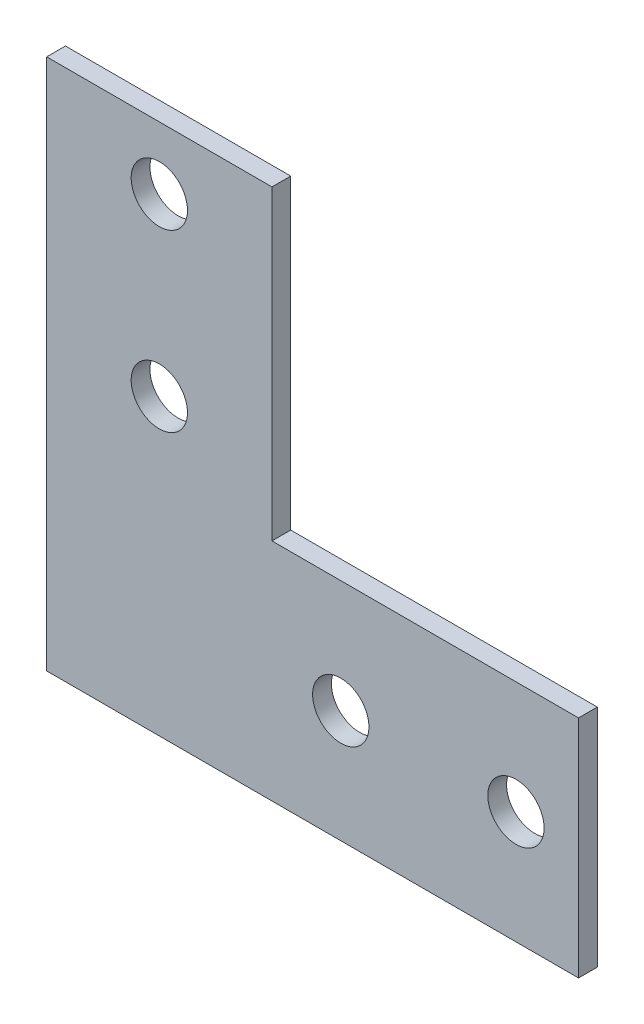
ISO-10303-21;
HEADER;
FILE_DESCRIPTION(('STEP AP214'),'2;1');
FILE_NAME('part.step','',(''),(''),'','','');
FILE_SCHEMA(('AUTOMOTIVE_DESIGN { 1 0 10303 214 1 1 1 1 }'));
ENDSEC;
DATA;
#1=APPLICATION_CONTEXT('core data for automotive mechanical design processes');
#2=APPLICATION_PROTOCOL_DEFINITION('international standard','automotive_design',2000,#1);
#3=PRODUCT_CONTEXT('',#1,'mechanical');
#4=PRODUCT('Part','Part','',(#3));
#5=PRODUCT_RELATED_PRODUCT_CATEGORY('part','',(#4));
#6=PRODUCT_DEFINITION_FORMATION('','',#4);
#7=PRODUCT_DEFINITION_CONTEXT('part definition',#1,'design');
#8=PRODUCT_DEFINITION('design','',#6,#7);
#9=PRODUCT_DEFINITION_SHAPE('','',#8);
#10=(LENGTH_UNIT() NAMED_UNIT(*) SI_UNIT(.MILLI.,.METRE.));
#11=(NAMED_UNIT(*) PLANE_ANGLE_UNIT() SI_UNIT($,.RADIAN.));
#12=(NAMED_UNIT(*) SI_UNIT($,.STERADIAN.) SOLID_ANGLE_UNIT());
#13=UNCERTAINTY_MEASURE_WITH_UNIT(LENGTH_MEASURE(1.E-05),#10,'distance_accuracy_value','');
#14=(GEOMETRIC_REPRESENTATION_CONTEXT(3) GLOBAL_UNCERTAINTY_ASSIGNED_CONTEXT((#13)) GLOBAL_UNIT_ASSIGNED_CONTEXT((#10,
#11,#12)) REPRESENTATION_CONTEXT('',''));
#15=CARTESIAN_POINT('',(0.,0.,0.));
#16=DIRECTION('',(0.,0.,1.));
#17=DIRECTION('',(1.,0.,0.));
#18=AXIS2_PLACEMENT_3D('',#15,#16,#17);
#19=CARTESIAN_POINT('',(0.,0.,3.));
#20=DIRECTION('',(0.,0.,1.));
#21=DIRECTION('',(1.,0.,0.));
#22=AXIS2_PLACEMENT_3D('',#19,#20,#21);
#23=PLANE('',#22);
#24=CARTESIAN_POINT('',(47.,18.,3.));
#25=DIRECTION('',(0.,0.,1.));
#26=DIRECTION('',(1.,0.,0.));
#27=AXIS2_PLACEMENT_3D('',#24,#25,#26);
#28=CIRCLE('',#27,4.5);
#29=CARTESIAN_POINT('',(51.5,18.,3.));
#30=VERTEX_POINT('',#29);
#31=EDGE_CURVE('E190',#30,#30,#28,.T.);
#32=ORIENTED_EDGE('',*,*,#31,.F.);
#33=EDGE_LOOP('',(#32));
#34=FACE_BOUND('',#33,.T.);
#35=CARTESIAN_POINT('',(18.,75.,3.));
#36=DIRECTION('',(0.,0.,1.));
#37=DIRECTION('',(1.,0.,0.));
#38=AXIS2_PLACEMENT_3D('',#35,#36,#37);
#39=CIRCLE('',#38,4.5);
#40=CARTESIAN_POINT('',(22.5,75.,3.));
#41=VERTEX_POINT('',#40);
#42=EDGE_CURVE('E123',#41,#41,#39,.T.);
#43=ORIENTED_EDGE('',*,*,#42,.F.);
#44=EDGE_LOOP('',(#43));
#45=FACE_BOUND('',#44,.T.);
#46=DIRECTION('',(-1.,0.,0.));
#47=VECTOR('',#46,1.);
#48=CARTESIAN_POINT('',(36.,85.,3.));
#49=LINE('',#48,#47);
#50=CARTESIAN_POINT('',(36.,85.,3.));
#51=VERTEX_POINT('',#50);
#52=CARTESIAN_POINT('',(0.,85.,3.));
#53=VERTEX_POINT('',#52);
#54=EDGE_CURVE('E130',#51,#53,#49,.T.);
#55=ORIENTED_EDGE('',*,*,#54,.T.);
#56=DIRECTION('',(0.,-1.,0.));
#57=VECTOR('',#56,1.);
#58=CARTESIAN_POINT('',(0.,85.,3.));
#59=LINE('',#58,#57);
#60=CARTESIAN_POINT('',(0.,0.,3.));
#61=VERTEX_POINT('',#60);
#62=EDGE_CURVE('E88',#53,#61,#59,.T.);
#63=ORIENTED_EDGE('',*,*,#62,.T.);
#64=DIRECTION('',(1.,0.,0.));
#65=VECTOR('',#64,1.);
#66=CARTESIAN_POINT('',(0.,0.,3.));
#67=LINE('',#66,#65);
#68=CARTESIAN_POINT('',(85.,0.,3.));
#69=VERTEX_POINT('',#68);
#70=EDGE_CURVE('E101',#61,#69,#67,.T.);
#71=ORIENTED_EDGE('',*,*,#70,.T.);
#72=DIRECTION('',(0.,1.,0.));
#73=VECTOR('',#72,1.);
#74=CARTESIAN_POINT('',(85.,0.,3.));
#75=LINE('',#74,#73);
#76=CARTESIAN_POINT('',(85.,36.,3.));
#77=VERTEX_POINT('',#76);
#78=EDGE_CURVE('E95',#69,#77,#75,.T.);
#79=ORIENTED_EDGE('',*,*,#78,.T.);
#80=DIRECTION('',(-1.,0.,0.));
#81=VECTOR('',#80,1.);
#82=CARTESIAN_POINT('',(85.,36.,3.));
#83=LINE('',#82,#81);
#84=CARTESIAN_POINT('',(36.,36.,3.));
#85=VERTEX_POINT('',#84);
#86=EDGE_CURVE('E99',#77,#85,#83,.T.);
#87=ORIENTED_EDGE('',*,*,#86,.T.);
#88=DIRECTION('',(0.,1.,0.));
#89=VECTOR('',#88,1.);
#90=CARTESIAN_POINT('',(36.,36.,3.));
#91=LINE('',#90,#89);
#92=EDGE_CURVE('E51',#85,#51,#91,.T.);
#93=ORIENTED_EDGE('',*,*,#92,.T.);
#94=EDGE_LOOP('',(#55,#63,#71,#79,#87,#93));
#95=FACE_BOUND('',#94,.T.);
#96=CARTESIAN_POINT('',(18.,47.,3.));
#97=DIRECTION('',(0.,0.,1.));
#98=DIRECTION('',(1.,0.,0.));
#99=AXIS2_PLACEMENT_3D('',#96,#97,#98);
#100=CIRCLE('',#99,4.5);
#101=CARTESIAN_POINT('',(22.5,47.,3.));
#102=VERTEX_POINT('',#101);
#103=EDGE_CURVE('E196',#102,#102,#100,.T.);
#104=ORIENTED_EDGE('',*,*,#103,.F.);
#105=EDGE_LOOP('',(#104));
#106=FACE_BOUND('',#105,.T.);
#107=CARTESIAN_POINT('',(75.,18.,3.));
#108=DIRECTION('',(0.,0.,1.));
#109=DIRECTION('',(1.,0.,0.));
#110=AXIS2_PLACEMENT_3D('',#107,#108,#109);
#111=CIRCLE('',#110,4.5);
#112=CARTESIAN_POINT('',(79.5,18.,3.));
#113=VERTEX_POINT('',#112);
#114=EDGE_CURVE('E181',#113,#113,#111,.T.);
#115=ORIENTED_EDGE('',*,*,#114,.F.);
#116=EDGE_LOOP('',(#115));
#117=FACE_BOUND('',#116,.T.);
#118=ADVANCED_FACE('F34',(#34,#45,#95,#106,#117),#23,.T.);
#119=CARTESIAN_POINT('',(0.,0.,0.));
#120=DIRECTION('',(0.,0.,1.));
#121=DIRECTION('',(1.,0.,0.));
#122=AXIS2_PLACEMENT_3D('',#119,#120,#121);
#123=PLANE('',#122);
#124=DIRECTION('',(-1.,0.,0.));
#125=VECTOR('',#124,1.);
#126=CARTESIAN_POINT('',(36.,85.,0.));
#127=LINE('',#126,#125);
#128=CARTESIAN_POINT('',(36.,85.,0.));
#129=VERTEX_POINT('',#128);
#130=CARTESIAN_POINT('',(0.,85.,0.));
#131=VERTEX_POINT('',#130);
#132=EDGE_CURVE('E119',#129,#131,#127,.T.);
#133=ORIENTED_EDGE('',*,*,#132,.F.);
#134=DIRECTION('',(0.,1.,0.));
#135=VECTOR('',#134,1.);
#136=CARTESIAN_POINT('',(36.,36.,0.));
#137=LINE('',#136,#135);
#138=CARTESIAN_POINT('',(36.,36.,0.));
#139=VERTEX_POINT('',#138);
#140=EDGE_CURVE('E80',#139,#129,#137,.T.);
#141=ORIENTED_EDGE('',*,*,#140,.F.);
#142=DIRECTION('',(-1.,0.,0.));
#143=VECTOR('',#142,1.);
#144=CARTESIAN_POINT('',(85.,36.,0.));
#145=LINE('',#144,#143);
#146=CARTESIAN_POINT('',(85.,36.,0.));
#147=VERTEX_POINT('',#146);
#148=EDGE_CURVE('E74',#147,#139,#145,.T.);
#149=ORIENTED_EDGE('',*,*,#148,.F.);
#150=DIRECTION('',(0.,1.,0.));
#151=VECTOR('',#150,1.);
#152=CARTESIAN_POINT('',(85.,0.,0.));
#153=LINE('',#152,#151);
#154=CARTESIAN_POINT('',(85.,0.,0.));
#155=VERTEX_POINT('',#154);
#156=EDGE_CURVE('E109',#155,#147,#153,.T.);
#157=ORIENTED_EDGE('',*,*,#156,.F.);
#158=DIRECTION('',(1.,0.,0.));
#159=VECTOR('',#158,1.);
#160=CARTESIAN_POINT('',(0.,0.,0.));
#161=LINE('',#160,#159);
#162=CARTESIAN_POINT('',(0.,0.,0.));
#163=VERTEX_POINT('',#162);
#164=EDGE_CURVE('E125',#163,#155,#161,.T.);
#165=ORIENTED_EDGE('',*,*,#164,.F.);
#166=DIRECTION('',(0.,-1.,0.));
#167=VECTOR('',#166,1.);
#168=CARTESIAN_POINT('',(0.,85.,0.));
#169=LINE('',#168,#167);
#170=EDGE_CURVE('E122',#131,#163,#169,.T.);
#171=ORIENTED_EDGE('',*,*,#170,.F.);
#172=EDGE_LOOP('',(#133,#141,#149,#157,#165,#171));
#173=FACE_BOUND('',#172,.T.);
#174=CARTESIAN_POINT('',(18.,75.,0.));
#175=DIRECTION('',(0.,0.,1.));
#176=DIRECTION('',(1.,0.,0.));
#177=AXIS2_PLACEMENT_3D('',#174,#175,#176);
#178=CIRCLE('',#177,4.5);
#179=CARTESIAN_POINT('',(22.5,75.,0.));
#180=VERTEX_POINT('',#179);
#181=EDGE_CURVE('E199',#180,#180,#178,.T.);
#182=ORIENTED_EDGE('',*,*,#181,.T.);
#183=EDGE_LOOP('',(#182));
#184=FACE_BOUND('',#183,.T.);
#185=CARTESIAN_POINT('',(18.,47.,0.));
#186=DIRECTION('',(0.,0.,1.));
#187=DIRECTION('',(1.,0.,0.));
#188=AXIS2_PLACEMENT_3D('',#185,#186,#187);
#189=CIRCLE('',#188,4.5);
#190=CARTESIAN_POINT('',(22.5,47.,0.));
#191=VERTEX_POINT('',#190);
#192=EDGE_CURVE('E193',#191,#191,#189,.T.);
#193=ORIENTED_EDGE('',*,*,#192,.T.);
#194=EDGE_LOOP('',(#193));
#195=FACE_BOUND('',#194,.T.);
#196=CARTESIAN_POINT('',(47.,18.,0.));
#197=DIRECTION('',(0.,0.,1.));
#198=DIRECTION('',(1.,0.,0.));
#199=AXIS2_PLACEMENT_3D('',#196,#197,#198);
#200=CIRCLE('',#199,4.5);
#201=CARTESIAN_POINT('',(51.5,18.,0.));
#202=VERTEX_POINT('',#201);
#203=EDGE_CURVE('E187',#202,#202,#200,.T.);
#204=ORIENTED_EDGE('',*,*,#203,.T.);
#205=EDGE_LOOP('',(#204));
#206=FACE_BOUND('',#205,.T.);
#207=CARTESIAN_POINT('',(75.,18.,0.));
#208=DIRECTION('',(0.,0.,1.));
#209=DIRECTION('',(1.,0.,0.));
#210=AXIS2_PLACEMENT_3D('',#207,#208,#209);
#211=CIRCLE('',#210,4.5);
#212=CARTESIAN_POINT('',(79.5,18.,0.));
#213=VERTEX_POINT('',#212);
#214=EDGE_CURVE('E184',#213,#213,#211,.T.);
#215=ORIENTED_EDGE('',*,*,#214,.T.);
#216=EDGE_LOOP('',(#215));
#217=FACE_BOUND('',#216,.T.);
#218=ADVANCED_FACE('F139',(#173,#184,#195,#206,#217),#123,.F.);
#219=CARTESIAN_POINT('',(36.,85.,3.));
#220=DIRECTION('',(0.,-1.,0.));
#221=DIRECTION('',(1.,0.,0.));
#222=AXIS2_PLACEMENT_3D('',#219,#220,#221);
#223=PLANE('',#222);
#224=ORIENTED_EDGE('',*,*,#132,.T.);
#225=DIRECTION('',(0.,0.,-1.));
#226=VECTOR('',#225,1.);
#227=CARTESIAN_POINT('',(0.,85.,3.));
#228=LINE('',#227,#226);
#229=EDGE_CURVE('E11',#53,#131,#228,.T.);
#230=ORIENTED_EDGE('',*,*,#229,.F.);
#231=ORIENTED_EDGE('',*,*,#54,.F.);
#232=DIRECTION('',(0.,0.,-1.));
#233=VECTOR('',#232,1.);
#234=CARTESIAN_POINT('',(36.,85.,3.));
#235=LINE('',#234,#233);
#236=EDGE_CURVE('E115',#51,#129,#235,.T.);
#237=ORIENTED_EDGE('',*,*,#236,.T.);
#238=EDGE_LOOP('',(#224,#230,#231,#237));
#239=FACE_BOUND('',#238,.T.);
#240=ADVANCED_FACE('F36',(#239),#223,.F.);
#241=CARTESIAN_POINT('',(0.,85.,3.));
#242=DIRECTION('',(1.,0.,0.));
#243=DIRECTION('',(0.,1.,0.));
#244=AXIS2_PLACEMENT_3D('',#241,#242,#243);
#245=PLANE('',#244);
#246=ORIENTED_EDGE('',*,*,#170,.T.);
#247=DIRECTION('',(0.,0.,-1.));
#248=VECTOR('',#247,1.);
#249=CARTESIAN_POINT('',(0.,0.,3.));
#250=LINE('',#249,#248);
#251=EDGE_CURVE('E43',#61,#163,#250,.T.);
#252=ORIENTED_EDGE('',*,*,#251,.F.);
#253=ORIENTED_EDGE('',*,*,#62,.F.);
#254=ORIENTED_EDGE('',*,*,#229,.T.);
#255=EDGE_LOOP('',(#246,#252,#253,#254));
#256=FACE_BOUND('',#255,.T.);
#257=ADVANCED_FACE('F257',(#256),#245,.F.);
#258=CARTESIAN_POINT('',(0.,0.,3.));
#259=DIRECTION('',(0.,1.,0.));
#260=DIRECTION('',(0.,0.,1.));
#261=AXIS2_PLACEMENT_3D('',#258,#259,#260);
#262=PLANE('',#261);
#263=ORIENTED_EDGE('',*,*,#164,.T.);
#264=DIRECTION('',(0.,0.,-1.));
#265=VECTOR('',#264,1.);
#266=CARTESIAN_POINT('',(85.,0.,3.));
#267=LINE('',#266,#265);
#268=EDGE_CURVE('E110',#69,#155,#267,.T.);
#269=ORIENTED_EDGE('',*,*,#268,.F.);
#270=ORIENTED_EDGE('',*,*,#70,.F.);
#271=ORIENTED_EDGE('',*,*,#251,.T.);
#272=EDGE_LOOP('',(#263,#269,#270,#271));
#273=FACE_BOUND('',#272,.T.);
#274=ADVANCED_FACE('F136',(#273),#262,.F.);
#275=CARTESIAN_POINT('',(85.,0.,3.));
#276=DIRECTION('',(-1.,0.,0.));
#277=DIRECTION('',(0.,-1.,0.));
#278=AXIS2_PLACEMENT_3D('',#275,#276,#277);
#279=PLANE('',#278);
#280=ORIENTED_EDGE('',*,*,#156,.T.);
#281=DIRECTION('',(0.,0.,-1.));
#282=VECTOR('',#281,1.);
#283=CARTESIAN_POINT('',(85.,36.,3.));
#284=LINE('',#283,#282);
#285=EDGE_CURVE('E106',#77,#147,#284,.T.);
#286=ORIENTED_EDGE('',*,*,#285,.F.);
#287=ORIENTED_EDGE('',*,*,#78,.F.);
#288=ORIENTED_EDGE('',*,*,#268,.T.);
#289=EDGE_LOOP('',(#280,#286,#287,#288));
#290=FACE_BOUND('',#289,.T.);
#291=ADVANCED_FACE('F107',(#290),#279,.F.);
#292=CARTESIAN_POINT('',(85.,36.,3.));
#293=DIRECTION('',(0.,-1.,0.));
#294=DIRECTION('',(1.,0.,0.));
#295=AXIS2_PLACEMENT_3D('',#292,#293,#294);
#296=PLANE('',#295);
#297=ORIENTED_EDGE('',*,*,#148,.T.);
#298=DIRECTION('',(0.,0.,-1.));
#299=VECTOR('',#298,1.);
#300=CARTESIAN_POINT('',(36.,36.,3.));
#301=LINE('',#300,#299);
#302=EDGE_CURVE('E111',#85,#139,#301,.T.);
#303=ORIENTED_EDGE('',*,*,#302,.F.);
#304=ORIENTED_EDGE('',*,*,#86,.F.);
#305=ORIENTED_EDGE('',*,*,#285,.T.);
#306=EDGE_LOOP('',(#297,#303,#304,#305));
#307=FACE_BOUND('',#306,.T.);
#308=ADVANCED_FACE('F113',(#307),#296,.F.);
#309=CARTESIAN_POINT('',(36.,36.,3.));
#310=DIRECTION('',(-1.,0.,0.));
#311=DIRECTION('',(0.,-1.,0.));
#312=AXIS2_PLACEMENT_3D('',#309,#310,#311);
#313=PLANE('',#312);
#314=ORIENTED_EDGE('',*,*,#140,.T.);
#315=ORIENTED_EDGE('',*,*,#236,.F.);
#316=ORIENTED_EDGE('',*,*,#92,.F.);
#317=ORIENTED_EDGE('',*,*,#302,.T.);
#318=EDGE_LOOP('',(#314,#315,#316,#317));
#319=FACE_BOUND('',#318,.T.);
#320=ADVANCED_FACE('F144',(#319),#313,.F.);
#321=CARTESIAN_POINT('',(18.,75.,3.));
#322=DIRECTION('',(0.,0.,-1.));
#323=DIRECTION('',(-1.,0.,0.));
#324=AXIS2_PLACEMENT_3D('',#321,#322,#323);
#325=CYLINDRICAL_SURFACE('',#324,4.5);
#326=ORIENTED_EDGE('',*,*,#42,.T.);
#327=EDGE_LOOP('',(#326));
#328=FACE_BOUND('',#327,.T.);
#329=ORIENTED_EDGE('',*,*,#181,.F.);
#330=EDGE_LOOP('',(#329));
#331=FACE_BOUND('',#330,.T.);
#332=ADVANCED_FACE('F146',(#328,#331),#325,.F.);
#333=CARTESIAN_POINT('',(18.,47.,3.));
#334=DIRECTION('',(0.,0.,-1.));
#335=DIRECTION('',(-1.,0.,0.));
#336=AXIS2_PLACEMENT_3D('',#333,#334,#335);
#337=CYLINDRICAL_SURFACE('',#336,4.5);
#338=ORIENTED_EDGE('',*,*,#103,.T.);
#339=EDGE_LOOP('',(#338));
#340=FACE_BOUND('',#339,.T.);
#341=ORIENTED_EDGE('',*,*,#192,.F.);
#342=EDGE_LOOP('',(#341));
#343=FACE_BOUND('',#342,.T.);
#344=ADVANCED_FACE('F152',(#340,#343),#337,.F.);
#345=CARTESIAN_POINT('',(47.,18.,3.));
#346=DIRECTION('',(0.,0.,-1.));
#347=DIRECTION('',(-1.,0.,0.));
#348=AXIS2_PLACEMENT_3D('',#345,#346,#347);
#349=CYLINDRICAL_SURFACE('',#348,4.5);
#350=ORIENTED_EDGE('',*,*,#31,.T.);
#351=EDGE_LOOP('',(#350));
#352=FACE_BOUND('',#351,.T.);
#353=ORIENTED_EDGE('',*,*,#203,.F.);
#354=EDGE_LOOP('',(#353));
#355=FACE_BOUND('',#354,.T.);
#356=ADVANCED_FACE('F168',(#352,#355),#349,.F.);
#357=CARTESIAN_POINT('',(75.,18.,3.));
#358=DIRECTION('',(0.,0.,-1.));
#359=DIRECTION('',(-1.,0.,0.));
#360=AXIS2_PLACEMENT_3D('',#357,#358,#359);
#361=CYLINDRICAL_SURFACE('',#360,4.5);
#362=ORIENTED_EDGE('',*,*,#114,.T.);
#363=EDGE_LOOP('',(#362));
#364=FACE_BOUND('',#363,.T.);
#365=ORIENTED_EDGE('',*,*,#214,.F.);
#366=EDGE_LOOP('',(#365));
#367=FACE_BOUND('',#366,.T.);
#368=ADVANCED_FACE('F172',(#364,#367),#361,.F.);
#369=CLOSED_SHELL('',(#118,#218,#240,#257,#274,#291,#308,#320,#332,#344,#356,#368));
#370=MANIFOLD_SOLID_BREP('B2',#369);
#371=ADVANCED_BREP_SHAPE_REPRESENTATION('',(#18,#370),#14);
#372=SHAPE_DEFINITION_REPRESENTATION(#9,#371);
ENDSEC;
END-ISO-10303-21;
